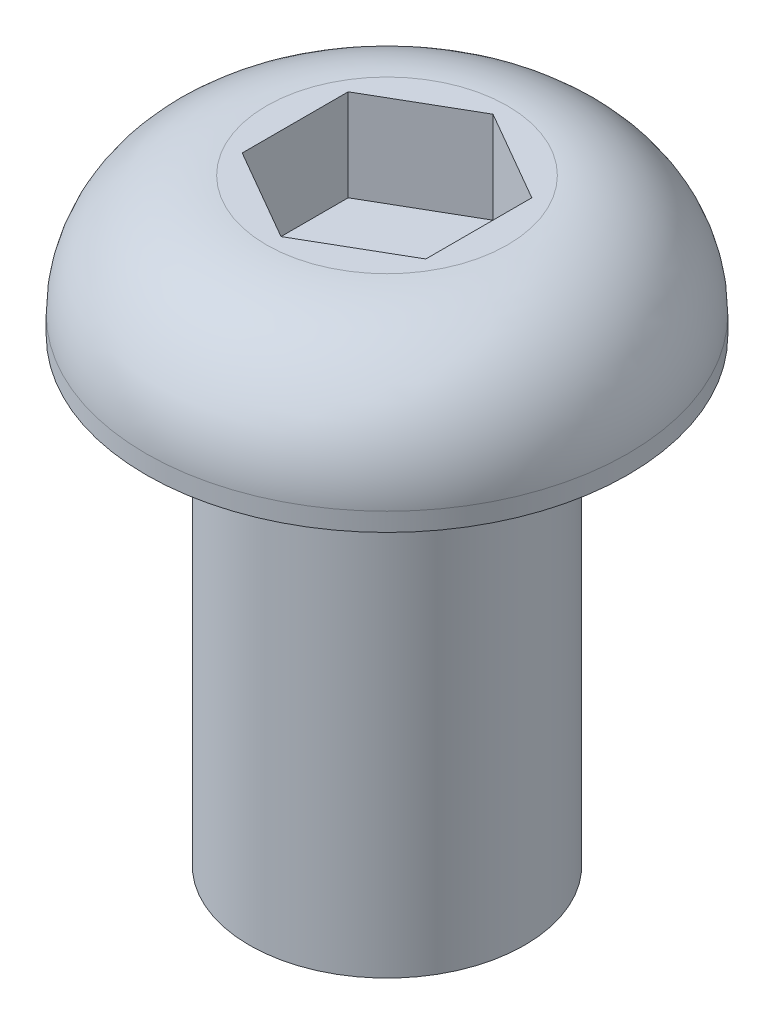
ISO-10303-21;
HEADER;
FILE_DESCRIPTION(('STEP AP214'),'2;1');
FILE_NAME('part.step','',(''),(''),'','','');
FILE_SCHEMA(('AUTOMOTIVE_DESIGN { 1 0 10303 214 1 1 1 1 }'));
ENDSEC;
DATA;
#1=APPLICATION_CONTEXT('core data for automotive mechanical design processes');
#2=APPLICATION_PROTOCOL_DEFINITION('international standard','automotive_design',2000,#1);
#3=PRODUCT_CONTEXT('',#1,'mechanical');
#4=PRODUCT('Part','Part','',(#3));
#5=PRODUCT_RELATED_PRODUCT_CATEGORY('part','',(#4));
#6=PRODUCT_DEFINITION_FORMATION('','',#4);
#7=PRODUCT_DEFINITION_CONTEXT('part definition',#1,'design');
#8=PRODUCT_DEFINITION('design','',#6,#7);
#9=PRODUCT_DEFINITION_SHAPE('','',#8);
#10=(LENGTH_UNIT() NAMED_UNIT(*) SI_UNIT(.MILLI.,.METRE.));
#11=(NAMED_UNIT(*) PLANE_ANGLE_UNIT() SI_UNIT($,.RADIAN.));
#12=(NAMED_UNIT(*) SI_UNIT($,.STERADIAN.) SOLID_ANGLE_UNIT());
#13=UNCERTAINTY_MEASURE_WITH_UNIT(LENGTH_MEASURE(1.E-05),#10,'distance_accuracy_value','');
#14=(GEOMETRIC_REPRESENTATION_CONTEXT(3) GLOBAL_UNCERTAINTY_ASSIGNED_CONTEXT((#13)) GLOBAL_UNIT_ASSIGNED_CONTEXT((#10,
#11,#12)) REPRESENTATION_CONTEXT('',''));
#15=CARTESIAN_POINT('',(0.,0.,0.));
#16=DIRECTION('',(0.,0.,1.));
#17=DIRECTION('',(1.,0.,0.));
#18=AXIS2_PLACEMENT_3D('',#15,#16,#17);
#19=CARTESIAN_POINT('',(0.,0.,0.));
#20=DIRECTION('',(0.,1.,0.));
#21=DIRECTION('',(-1.,0.,0.));
#22=AXIS2_PLACEMENT_3D('',#19,#20,#21);
#23=PLANE('',#22);
#24=CARTESIAN_POINT('',(0.,0.,0.));
#25=DIRECTION('',(0.,1.,0.));
#26=DIRECTION('',(-1.,0.,0.));
#27=AXIS2_PLACEMENT_3D('',#24,#25,#26);
#28=CIRCLE('',#27,6.);
#29=CARTESIAN_POINT('',(-6.,0.,0.));
#30=VERTEX_POINT('',#29);
#31=EDGE_CURVE('E11',#30,#30,#28,.T.);
#32=ORIENTED_EDGE('',*,*,#31,.F.);
#33=EDGE_LOOP('',(#32));
#34=FACE_BOUND('',#33,.T.);
#35=ADVANCED_FACE('F33',(#34),#23,.F.);
#36=CARTESIAN_POINT('',(0.,26.05,0.));
#37=DIRECTION('',(0.,1.,0.));
#38=DIRECTION('',(-1.,0.,0.));
#39=AXIS2_PLACEMENT_3D('',#36,#37,#38);
#40=CYLINDRICAL_SURFACE('',#39,6.);
#41=CARTESIAN_POINT('',(0.,20.,0.));
#42=DIRECTION('',(0.,1.,0.));
#43=DIRECTION('',(-1.,0.,0.));
#44=AXIS2_PLACEMENT_3D('',#41,#42,#43);
#45=CIRCLE('',#44,6.);
#46=CARTESIAN_POINT('',(-6.00000000000001,20.,0.));
#47=VERTEX_POINT('',#46);
#48=EDGE_CURVE('E40',#47,#47,#45,.T.);
#49=ORIENTED_EDGE('',*,*,#48,.F.);
#50=EDGE_LOOP('',(#49));
#51=FACE_BOUND('',#50,.T.);
#52=ORIENTED_EDGE('',*,*,#31,.T.);
#53=EDGE_LOOP('',(#52));
#54=FACE_BOUND('',#53,.T.);
#55=ADVANCED_FACE('F152',(#51,#54),#40,.T.);
#56=CARTESIAN_POINT('',(6.,20.,0.));
#57=DIRECTION('',(0.,1.,0.));
#58=DIRECTION('',(-1.,0.,0.));
#59=AXIS2_PLACEMENT_3D('',#56,#57,#58);
#60=PLANE('',#59);
#61=CARTESIAN_POINT('',(0.,20.,0.));
#62=DIRECTION('',(0.,1.,0.));
#63=DIRECTION('',(-1.,0.,0.));
#64=AXIS2_PLACEMENT_3D('',#61,#62,#63);
#65=CIRCLE('',#64,10.5);
#66=CARTESIAN_POINT('',(-10.5,20.,0.));
#67=VERTEX_POINT('',#66);
#68=EDGE_CURVE('E145',#67,#67,#65,.T.);
#69=ORIENTED_EDGE('',*,*,#68,.F.);
#70=EDGE_LOOP('',(#69));
#71=FACE_BOUND('',#70,.T.);
#72=ORIENTED_EDGE('',*,*,#48,.T.);
#73=EDGE_LOOP('',(#72));
#74=FACE_BOUND('',#73,.T.);
#75=ADVANCED_FACE('F150',(#71,#74),#60,.F.);
#76=CARTESIAN_POINT('',(0.,26.05,0.));
#77=DIRECTION('',(0.,1.,0.));
#78=DIRECTION('',(-1.,0.,0.));
#79=AXIS2_PLACEMENT_3D('',#76,#77,#78);
#80=CYLINDRICAL_SURFACE('',#79,10.5);
#81=CARTESIAN_POINT('',(0.,20.8,0.));
#82=DIRECTION('',(0.,1.,0.));
#83=DIRECTION('',(-1.,0.,0.));
#84=AXIS2_PLACEMENT_3D('',#81,#82,#83);
#85=CIRCLE('',#84,10.5);
#86=CARTESIAN_POINT('',(-10.5,20.8,0.));
#87=VERTEX_POINT('',#86);
#88=EDGE_CURVE('E142',#87,#87,#85,.T.);
#89=ORIENTED_EDGE('',*,*,#88,.F.);
#90=EDGE_LOOP('',(#89));
#91=FACE_BOUND('',#90,.T.);
#92=ORIENTED_EDGE('',*,*,#68,.T.);
#93=EDGE_LOOP('',(#92));
#94=FACE_BOUND('',#93,.T.);
#95=ADVANCED_FACE('F170',(#91,#94),#80,.T.);
#96=CARTESIAN_POINT('',(0.,20.8,0.));
#97=DIRECTION('',(0.,1.,0.));
#98=DIRECTION('',(-1.,0.,0.));
#99=AXIS2_PLACEMENT_3D('',#96,#97,#98);
#100=TOROIDAL_SURFACE('',#99,5.25,5.25);
#101=CARTESIAN_POINT('',(0.,26.05,0.));
#102=DIRECTION('',(0.,1.,0.));
#103=DIRECTION('',(-1.,0.,0.));
#104=AXIS2_PLACEMENT_3D('',#101,#102,#103);
#105=CIRCLE('',#104,5.25);
#106=CARTESIAN_POINT('',(-5.25000000000001,26.05,0.));
#107=VERTEX_POINT('',#106);
#108=EDGE_CURVE('E134',#107,#107,#105,.T.);
#109=ORIENTED_EDGE('',*,*,#108,.F.);
#110=EDGE_LOOP('',(#109));
#111=FACE_BOUND('',#110,.T.);
#112=ORIENTED_EDGE('',*,*,#88,.T.);
#113=EDGE_LOOP('',(#112));
#114=FACE_BOUND('',#113,.T.);
#115=ADVANCED_FACE('F178',(#111,#114),#100,.T.);
#116=CARTESIAN_POINT('',(5.25,26.05,0.));
#117=DIRECTION('',(0.,-1.,0.));
#118=DIRECTION('',(1.,0.,0.));
#119=AXIS2_PLACEMENT_3D('',#116,#117,#118);
#120=PLANE('',#119);
#121=DIRECTION('',(0.866025403784438,0.,0.5));
#122=VECTOR('',#121,1.);
#123=CARTESIAN_POINT('',(-4.,26.05,2.3094010767585));
#124=LINE('',#123,#122);
#125=CARTESIAN_POINT('',(-4.,26.05,2.3094010767585));
#126=VERTEX_POINT('',#125);
#127=CARTESIAN_POINT('',(0.,26.05,4.61880215351701));
#128=VERTEX_POINT('',#127);
#129=EDGE_CURVE('E121',#126,#128,#124,.T.);
#130=ORIENTED_EDGE('',*,*,#129,.F.);
#131=DIRECTION('',(0.,0.,1.));
#132=VECTOR('',#131,1.);
#133=CARTESIAN_POINT('',(-4.,26.05,-2.30940107675851));
#134=LINE('',#133,#132);
#135=CARTESIAN_POINT('',(-4.,26.05,-2.30940107675851));
#136=VERTEX_POINT('',#135);
#137=EDGE_CURVE('E47',#136,#126,#134,.T.);
#138=ORIENTED_EDGE('',*,*,#137,.F.);
#139=DIRECTION('',(-0.866025403784439,0.,0.5));
#140=VECTOR('',#139,1.);
#141=CARTESIAN_POINT('',(0.,26.05,-4.61880215351701));
#142=LINE('',#141,#140);
#143=CARTESIAN_POINT('',(0.,26.05,-4.61880215351701));
#144=VERTEX_POINT('',#143);
#145=EDGE_CURVE('E130',#144,#136,#142,.T.);
#146=ORIENTED_EDGE('',*,*,#145,.F.);
#147=DIRECTION('',(-0.866025403784439,0.,-0.5));
#148=VECTOR('',#147,1.);
#149=CARTESIAN_POINT('',(4.,26.05,-2.3094010767585));
#150=LINE('',#149,#148);
#151=CARTESIAN_POINT('',(4.,26.05,-2.3094010767585));
#152=VERTEX_POINT('',#151);
#153=EDGE_CURVE('E128',#152,#144,#150,.T.);
#154=ORIENTED_EDGE('',*,*,#153,.F.);
#155=DIRECTION('',(0.,0.,-1.));
#156=VECTOR('',#155,1.);
#157=CARTESIAN_POINT('',(4.,26.05,2.3094010767585));
#158=LINE('',#157,#156);
#159=CARTESIAN_POINT('',(4.,26.05,2.3094010767585));
#160=VERTEX_POINT('',#159);
#161=EDGE_CURVE('E95',#160,#152,#158,.T.);
#162=ORIENTED_EDGE('',*,*,#161,.F.);
#163=DIRECTION('',(0.866025403784439,0.,-0.5));
#164=VECTOR('',#163,1.);
#165=CARTESIAN_POINT('',(0.,26.05,4.61880215351701));
#166=LINE('',#165,#164);
#167=EDGE_CURVE('E124',#128,#160,#166,.T.);
#168=ORIENTED_EDGE('',*,*,#167,.F.);
#169=EDGE_LOOP('',(#130,#138,#146,#154,#162,#168));
#170=FACE_BOUND('',#169,.T.);
#171=ORIENTED_EDGE('',*,*,#108,.T.);
#172=EDGE_LOOP('',(#171));
#173=FACE_BOUND('',#172,.T.);
#174=ADVANCED_FACE('F186',(#170,#173),#120,.F.);
#175=CARTESIAN_POINT('',(-4.,22.05,-2.30940107675851));
#176=DIRECTION('',(-1.,0.,0.));
#177=DIRECTION('',(0.,-1.,0.));
#178=AXIS2_PLACEMENT_3D('',#175,#176,#177);
#179=PLANE('',#178);
#180=ORIENTED_EDGE('',*,*,#137,.T.);
#181=DIRECTION('',(0.,1.,0.));
#182=VECTOR('',#181,1.);
#183=CARTESIAN_POINT('',(-4.,22.05,2.3094010767585));
#184=LINE('',#183,#182);
#185=CARTESIAN_POINT('',(-4.,22.05,2.3094010767585));
#186=VERTEX_POINT('',#185);
#187=EDGE_CURVE('E77',#186,#126,#184,.T.);
#188=ORIENTED_EDGE('',*,*,#187,.F.);
#189=DIRECTION('',(0.,0.,1.));
#190=VECTOR('',#189,1.);
#191=CARTESIAN_POINT('',(-4.,22.05,-2.30940107675851));
#192=LINE('',#191,#190);
#193=CARTESIAN_POINT('',(-4.,22.05,-2.30940107675851));
#194=VERTEX_POINT('',#193);
#195=EDGE_CURVE('E132',#194,#186,#192,.T.);
#196=ORIENTED_EDGE('',*,*,#195,.F.);
#197=DIRECTION('',(0.,1.,0.));
#198=VECTOR('',#197,1.);
#199=CARTESIAN_POINT('',(-4.,22.05,-2.30940107675851));
#200=LINE('',#199,#198);
#201=EDGE_CURVE('E55',#194,#136,#200,.T.);
#202=ORIENTED_EDGE('',*,*,#201,.T.);
#203=EDGE_LOOP('',(#180,#188,#196,#202));
#204=FACE_BOUND('',#203,.T.);
#205=ADVANCED_FACE('F194',(#204),#179,.F.);
#206=CARTESIAN_POINT('',(0.,22.05,-4.61880215351701));
#207=DIRECTION('',(-0.5,0.,-0.866025403784439));
#208=DIRECTION('',(-0.866025403784439,0.,0.5));
#209=AXIS2_PLACEMENT_3D('',#206,#207,#208);
#210=PLANE('',#209);
#211=ORIENTED_EDGE('',*,*,#145,.T.);
#212=ORIENTED_EDGE('',*,*,#201,.F.);
#213=DIRECTION('',(-0.866025403784439,0.,0.5));
#214=VECTOR('',#213,1.);
#215=CARTESIAN_POINT('',(0.,22.05,-4.61880215351701));
#216=LINE('',#215,#214);
#217=CARTESIAN_POINT('',(0.,22.05,-4.61880215351701));
#218=VERTEX_POINT('',#217);
#219=EDGE_CURVE('E107',#218,#194,#216,.T.);
#220=ORIENTED_EDGE('',*,*,#219,.F.);
#221=DIRECTION('',(0.,1.,0.));
#222=VECTOR('',#221,1.);
#223=CARTESIAN_POINT('',(0.,22.05,-4.61880215351701));
#224=LINE('',#223,#222);
#225=EDGE_CURVE('E99',#218,#144,#224,.T.);
#226=ORIENTED_EDGE('',*,*,#225,.T.);
#227=EDGE_LOOP('',(#211,#212,#220,#226));
#228=FACE_BOUND('',#227,.T.);
#229=ADVANCED_FACE('F202',(#228),#210,.F.);
#230=CARTESIAN_POINT('',(4.,22.05,-2.3094010767585));
#231=DIRECTION('',(0.5,0.,-0.866025403784439));
#232=DIRECTION('',(-0.866025403784439,0.,-0.5));
#233=AXIS2_PLACEMENT_3D('',#230,#231,#232);
#234=PLANE('',#233);
#235=ORIENTED_EDGE('',*,*,#153,.T.);
#236=ORIENTED_EDGE('',*,*,#225,.F.);
#237=DIRECTION('',(-0.866025403784439,0.,-0.5));
#238=VECTOR('',#237,1.);
#239=CARTESIAN_POINT('',(4.,22.05,-2.3094010767585));
#240=LINE('',#239,#238);
#241=CARTESIAN_POINT('',(4.,22.05,-2.3094010767585));
#242=VERTEX_POINT('',#241);
#243=EDGE_CURVE('E103',#242,#218,#240,.T.);
#244=ORIENTED_EDGE('',*,*,#243,.F.);
#245=DIRECTION('',(0.,1.,0.));
#246=VECTOR('',#245,1.);
#247=CARTESIAN_POINT('',(4.,22.05,-2.3094010767585));
#248=LINE('',#247,#246);
#249=EDGE_CURVE('E88',#242,#152,#248,.T.);
#250=ORIENTED_EDGE('',*,*,#249,.T.);
#251=EDGE_LOOP('',(#235,#236,#244,#250));
#252=FACE_BOUND('',#251,.T.);
#253=ADVANCED_FACE('F104',(#252),#234,.F.);
#254=CARTESIAN_POINT('',(4.,22.05,2.3094010767585));
#255=DIRECTION('',(1.,0.,0.));
#256=DIRECTION('',(0.,0.,-1.));
#257=AXIS2_PLACEMENT_3D('',#254,#255,#256);
#258=PLANE('',#257);
#259=ORIENTED_EDGE('',*,*,#161,.T.);
#260=ORIENTED_EDGE('',*,*,#249,.F.);
#261=DIRECTION('',(0.,0.,-1.));
#262=VECTOR('',#261,1.);
#263=CARTESIAN_POINT('',(4.,22.05,2.3094010767585));
#264=LINE('',#263,#262);
#265=CARTESIAN_POINT('',(4.,22.05,2.3094010767585));
#266=VERTEX_POINT('',#265);
#267=EDGE_CURVE('E92',#266,#242,#264,.T.);
#268=ORIENTED_EDGE('',*,*,#267,.F.);
#269=DIRECTION('',(0.,1.,0.));
#270=VECTOR('',#269,1.);
#271=CARTESIAN_POINT('',(4.,22.05,2.3094010767585));
#272=LINE('',#271,#270);
#273=EDGE_CURVE('E100',#266,#160,#272,.T.);
#274=ORIENTED_EDGE('',*,*,#273,.T.);
#275=EDGE_LOOP('',(#259,#260,#268,#274));
#276=FACE_BOUND('',#275,.T.);
#277=ADVANCED_FACE('F90',(#276),#258,.F.);
#278=CARTESIAN_POINT('',(0.,22.05,4.61880215351701));
#279=DIRECTION('',(0.5,0.,0.866025403784439));
#280=DIRECTION('',(0.866025403784439,0.,-0.5));
#281=AXIS2_PLACEMENT_3D('',#278,#279,#280);
#282=PLANE('',#281);
#283=ORIENTED_EDGE('',*,*,#167,.T.);
#284=ORIENTED_EDGE('',*,*,#273,.F.);
#285=DIRECTION('',(0.866025403784439,0.,-0.5));
#286=VECTOR('',#285,1.);
#287=CARTESIAN_POINT('',(0.,22.05,4.61880215351701));
#288=LINE('',#287,#286);
#289=CARTESIAN_POINT('',(0.,22.05,4.61880215351701));
#290=VERTEX_POINT('',#289);
#291=EDGE_CURVE('E113',#290,#266,#288,.T.);
#292=ORIENTED_EDGE('',*,*,#291,.F.);
#293=DIRECTION('',(0.,1.,0.));
#294=VECTOR('',#293,1.);
#295=CARTESIAN_POINT('',(0.,22.05,4.61880215351701));
#296=LINE('',#295,#294);
#297=EDGE_CURVE('E137',#290,#128,#296,.T.);
#298=ORIENTED_EDGE('',*,*,#297,.T.);
#299=EDGE_LOOP('',(#283,#284,#292,#298));
#300=FACE_BOUND('',#299,.T.);
#301=ADVANCED_FACE('F221',(#300),#282,.F.);
#302=CARTESIAN_POINT('',(-4.,22.05,2.3094010767585));
#303=DIRECTION('',(-0.5,0.,0.866025403784439));
#304=DIRECTION('',(0.866025403784438,0.,0.5));
#305=AXIS2_PLACEMENT_3D('',#302,#303,#304);
#306=PLANE('',#305);
#307=ORIENTED_EDGE('',*,*,#129,.T.);
#308=ORIENTED_EDGE('',*,*,#297,.F.);
#309=DIRECTION('',(0.866025403784438,0.,0.5));
#310=VECTOR('',#309,1.);
#311=CARTESIAN_POINT('',(-4.,22.05,2.3094010767585));
#312=LINE('',#311,#310);
#313=EDGE_CURVE('E115',#186,#290,#312,.T.);
#314=ORIENTED_EDGE('',*,*,#313,.F.);
#315=ORIENTED_EDGE('',*,*,#187,.T.);
#316=EDGE_LOOP('',(#307,#308,#314,#315));
#317=FACE_BOUND('',#316,.T.);
#318=ADVANCED_FACE('F228',(#317),#306,.F.);
#319=CARTESIAN_POINT('',(0.,22.05,0.));
#320=DIRECTION('',(0.,1.,0.));
#321=DIRECTION('',(0.,0.,1.));
#322=AXIS2_PLACEMENT_3D('',#319,#320,#321);
#323=PLANE('',#322);
#324=ORIENTED_EDGE('',*,*,#195,.T.);
#325=ORIENTED_EDGE('',*,*,#313,.T.);
#326=ORIENTED_EDGE('',*,*,#291,.T.);
#327=ORIENTED_EDGE('',*,*,#267,.T.);
#328=ORIENTED_EDGE('',*,*,#243,.T.);
#329=ORIENTED_EDGE('',*,*,#219,.T.);
#330=EDGE_LOOP('',(#324,#325,#326,#327,#328,#329));
#331=FACE_BOUND('',#330,.T.);
#332=ADVANCED_FACE('F110',(#331),#323,.T.);
#333=CLOSED_SHELL('',(#35,#55,#75,#95,#115,#174,#205,#229,#253,#277,#301,#318,#332));
#334=MANIFOLD_SOLID_BREP('B2',#333);
#335=ADVANCED_BREP_SHAPE_REPRESENTATION('',(#18,#334),#14);
#336=SHAPE_DEFINITION_REPRESENTATION(#9,#335);
ENDSEC;
END-ISO-10303-21;
